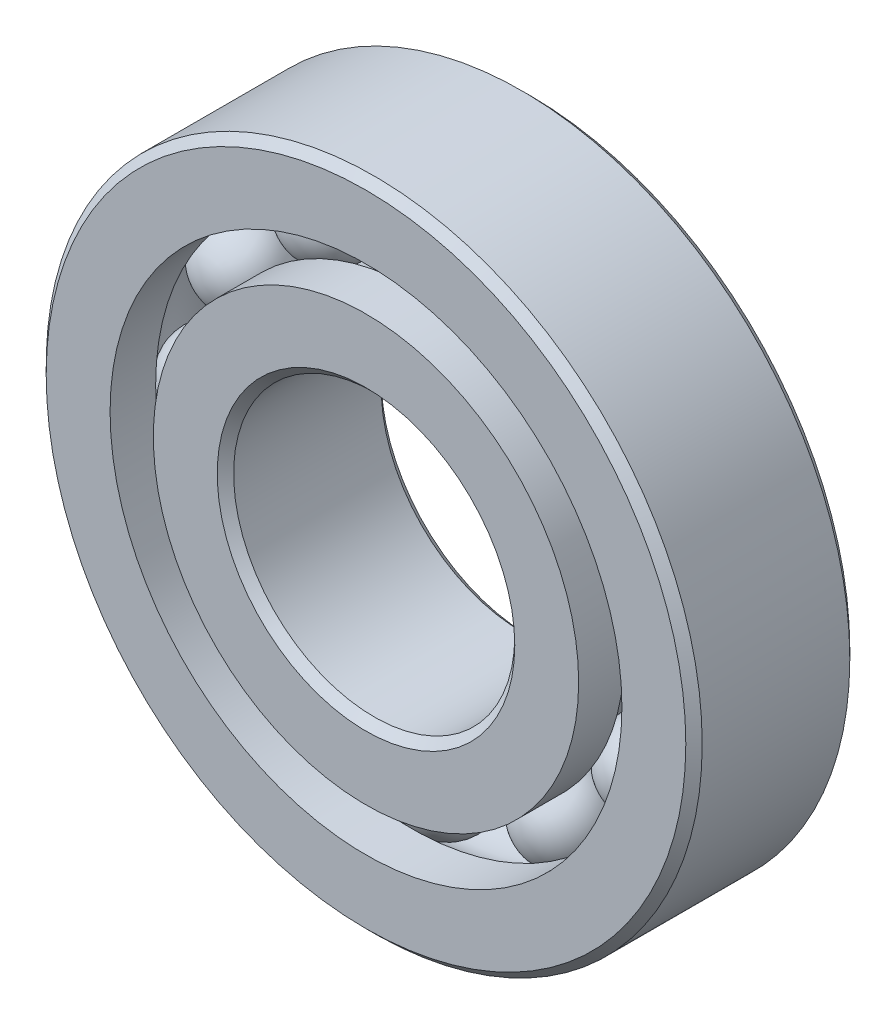
ISO-10303-21;
HEADER;
FILE_DESCRIPTION(('STEP AP214'),'2;1');
FILE_NAME('part.step','',(''),(''),'','','');
FILE_SCHEMA(('AUTOMOTIVE_DESIGN { 1 0 10303 214 1 1 1 1 }'));
ENDSEC;
DATA;
#1=APPLICATION_CONTEXT('core data for automotive mechanical design processes');
#2=APPLICATION_PROTOCOL_DEFINITION('international standard','automotive_design',2000,#1);
#3=PRODUCT_CONTEXT('',#1,'mechanical');
#4=PRODUCT('Part','Part','',(#3));
#5=PRODUCT_RELATED_PRODUCT_CATEGORY('part','',(#4));
#6=PRODUCT_DEFINITION_FORMATION('','',#4);
#7=PRODUCT_DEFINITION_CONTEXT('part definition',#1,'design');
#8=PRODUCT_DEFINITION('design','',#6,#7);
#9=PRODUCT_DEFINITION_SHAPE('','',#8);
#10=(LENGTH_UNIT() NAMED_UNIT(*) SI_UNIT(.MILLI.,.METRE.));
#11=(NAMED_UNIT(*) PLANE_ANGLE_UNIT() SI_UNIT($,.RADIAN.));
#12=(NAMED_UNIT(*) SI_UNIT($,.STERADIAN.) SOLID_ANGLE_UNIT());
#13=UNCERTAINTY_MEASURE_WITH_UNIT(LENGTH_MEASURE(1.E-05),#10,'distance_accuracy_value','');
#14=(GEOMETRIC_REPRESENTATION_CONTEXT(3) GLOBAL_UNCERTAINTY_ASSIGNED_CONTEXT((#13)) GLOBAL_UNIT_ASSIGNED_CONTEXT((#10,
#11,#12)) REPRESENTATION_CONTEXT('',''));
#15=CARTESIAN_POINT('',(0.,0.,0.));
#16=DIRECTION('',(0.,0.,1.));
#17=DIRECTION('',(1.,0.,0.));
#18=AXIS2_PLACEMENT_3D('',#15,#16,#17);
#19=CARTESIAN_POINT('',(-3.96874999999991,6.87407664253903,0.));
#20=DIRECTION('',(0.,0.,1.));
#21=DIRECTION('',(-0.499999999999989,0.866025403784445,0.));
#22=AXIS2_PLACEMENT_3D('',#19,#20,#21);
#23=SPHERICAL_SURFACE('',#22,1.43574962434293);
#24=CARTESIAN_POINT('',(-3.96874999999991,6.87407664253903,1.43574962434293));
#25=VERTEX_POINT('',#24);
#26=VERTEX_LOOP('',#25);
#27=FACE_BOUND('',#26,.T.);
#28=ADVANCED_FACE('F39',(#27),#23,.T.);
#29=CLOSED_SHELL('',(#28));
#30=MANIFOLD_SOLID_BREP('B2',#29);
#31=CARTESIAN_POINT('',(-6.87407664253894,3.96875000000008,0.));
#32=DIRECTION('',(0.,0.,1.));
#33=DIRECTION('',(-0.866025403784433,0.50000000000001,0.));
#34=AXIS2_PLACEMENT_3D('',#31,#32,#33);
#35=SPHERICAL_SURFACE('',#34,1.43574962434293);
#36=CARTESIAN_POINT('',(-6.87407664253894,3.96875000000008,1.43574962434293));
#37=VERTEX_POINT('',#36);
#38=VERTEX_LOOP('',#37);
#39=FACE_BOUND('',#38,.T.);
#40=ADVANCED_FACE('F59',(#39),#35,.T.);
#41=CLOSED_SHELL('',(#40));
#42=MANIFOLD_SOLID_BREP('B6',#41);
#43=CARTESIAN_POINT('',(-7.9375,0.,0.));
#44=DIRECTION('',(0.,0.,1.));
#45=DIRECTION('',(-1.,0.,0.));
#46=AXIS2_PLACEMENT_3D('',#43,#44,#45);
#47=SPHERICAL_SURFACE('',#46,1.43574962434293);
#48=CARTESIAN_POINT('',(-7.9375,0.,1.43574962434293));
#49=VERTEX_POINT('',#48);
#50=VERTEX_LOOP('',#49);
#51=FACE_BOUND('',#50,.T.);
#52=ADVANCED_FACE('F79',(#51),#47,.T.);
#53=CLOSED_SHELL('',(#52));
#54=MANIFOLD_SOLID_BREP('B35',#53);
#55=CARTESIAN_POINT('',(-6.87407664253902,-3.96874999999994,0.));
#56=DIRECTION('',(0.,0.,1.));
#57=DIRECTION('',(-0.866025403784443,-0.499999999999992,0.));
#58=AXIS2_PLACEMENT_3D('',#55,#56,#57);
#59=SPHERICAL_SURFACE('',#58,1.43574962434293);
#60=CARTESIAN_POINT('',(-6.87407664253902,-3.96874999999994,1.43574962434293));
#61=VERTEX_POINT('',#60);
#62=VERTEX_LOOP('',#61);
#63=FACE_BOUND('',#62,.T.);
#64=ADVANCED_FACE('F99',(#63),#59,.T.);
#65=CLOSED_SHELL('',(#64));
#66=MANIFOLD_SOLID_BREP('B55',#65);
#67=CARTESIAN_POINT('',(-3.96875000000006,-6.87407664253895,0.));
#68=DIRECTION('',(0.,0.,1.));
#69=DIRECTION('',(-0.500000000000007,-0.866025403784435,0.));
#70=AXIS2_PLACEMENT_3D('',#67,#68,#69);
#71=SPHERICAL_SURFACE('',#70,1.43574962434293);
#72=CARTESIAN_POINT('',(-3.96875000000006,-6.87407664253895,1.43574962434293));
#73=VERTEX_POINT('',#72);
#74=VERTEX_LOOP('',#73);
#75=FACE_BOUND('',#74,.T.);
#76=ADVANCED_FACE('F119',(#75),#71,.T.);
#77=CLOSED_SHELL('',(#76));
#78=MANIFOLD_SOLID_BREP('B75',#77);
#79=CARTESIAN_POINT('',(0.,-7.9375,0.));
#80=DIRECTION('',(0.,0.,1.));
#81=DIRECTION('',(0.,-1.,0.));
#82=AXIS2_PLACEMENT_3D('',#79,#80,#81);
#83=SPHERICAL_SURFACE('',#82,1.43574962434293);
#84=CARTESIAN_POINT('',(0.,-7.9375,1.43574962434293));
#85=VERTEX_POINT('',#84);
#86=VERTEX_LOOP('',#85);
#87=FACE_BOUND('',#86,.T.);
#88=ADVANCED_FACE('F139',(#87),#83,.T.);
#89=CLOSED_SHELL('',(#88));
#90=MANIFOLD_SOLID_BREP('B95',#89);
#91=CARTESIAN_POINT('',(3.96874999999996,-6.87407664253901,0.));
#92=DIRECTION('',(0.,0.,1.));
#93=DIRECTION('',(0.499999999999995,-0.866025403784442,0.));
#94=AXIS2_PLACEMENT_3D('',#91,#92,#93);
#95=SPHERICAL_SURFACE('',#94,1.43574962434293);
#96=CARTESIAN_POINT('',(3.96874999999996,-6.87407664253901,1.43574962434293));
#97=VERTEX_POINT('',#96);
#98=VERTEX_LOOP('',#97);
#99=FACE_BOUND('',#98,.T.);
#100=ADVANCED_FACE('F159',(#99),#95,.T.);
#101=CLOSED_SHELL('',(#100));
#102=MANIFOLD_SOLID_BREP('B115',#101);
#103=CARTESIAN_POINT('',(6.87407664253896,-3.96875000000003,0.));
#104=DIRECTION('',(0.,0.,1.));
#105=DIRECTION('',(0.866025403784436,-0.500000000000004,0.));
#106=AXIS2_PLACEMENT_3D('',#103,#104,#105);
#107=SPHERICAL_SURFACE('',#106,1.43574962434293);
#108=CARTESIAN_POINT('',(6.87407664253896,-3.96875000000003,1.43574962434293));
#109=VERTEX_POINT('',#108);
#110=VERTEX_LOOP('',#109);
#111=FACE_BOUND('',#110,.T.);
#112=ADVANCED_FACE('F179',(#111),#107,.T.);
#113=CLOSED_SHELL('',(#112));
#114=MANIFOLD_SOLID_BREP('B135',#113);
#115=CARTESIAN_POINT('',(7.9375,0.,0.));
#116=DIRECTION('',(0.,0.,1.));
#117=DIRECTION('',(1.,0.,0.));
#118=AXIS2_PLACEMENT_3D('',#115,#116,#117);
#119=SPHERICAL_SURFACE('',#118,1.43574962434293);
#120=CARTESIAN_POINT('',(7.9375,0.,1.43574962434293));
#121=VERTEX_POINT('',#120);
#122=VERTEX_LOOP('',#121);
#123=FACE_BOUND('',#122,.T.);
#124=ADVANCED_FACE('F199',(#123),#119,.T.);
#125=CLOSED_SHELL('',(#124));
#126=MANIFOLD_SOLID_BREP('B155',#125);
#127=CARTESIAN_POINT('',(6.87407664253899,3.96874999999998,0.));
#128=DIRECTION('',(0.,0.,1.));
#129=DIRECTION('',(0.86602540378444,0.499999999999998,0.));
#130=AXIS2_PLACEMENT_3D('',#127,#128,#129);
#131=SPHERICAL_SURFACE('',#130,1.43574962434293);
#132=CARTESIAN_POINT('',(6.87407664253899,3.96874999999998,1.43574962434293));
#133=VERTEX_POINT('',#132);
#134=VERTEX_LOOP('',#133);
#135=FACE_BOUND('',#134,.T.);
#136=ADVANCED_FACE('F219',(#135),#131,.T.);
#137=CLOSED_SHELL('',(#136));
#138=MANIFOLD_SOLID_BREP('B175',#137);
#139=CARTESIAN_POINT('',(3.96875000000001,6.87407664253898,0.));
#140=DIRECTION('',(0.,0.,1.));
#141=DIRECTION('',(0.500000000000001,0.866025403784438,0.));
#142=AXIS2_PLACEMENT_3D('',#139,#140,#141);
#143=SPHERICAL_SURFACE('',#142,1.43574962434293);
#144=CARTESIAN_POINT('',(3.96875000000001,6.87407664253898,1.43574962434293));
#145=VERTEX_POINT('',#144);
#146=VERTEX_LOOP('',#145);
#147=FACE_BOUND('',#146,.T.);
#148=ADVANCED_FACE('F239',(#147),#143,.T.);
#149=CLOSED_SHELL('',(#148));
#150=MANIFOLD_SOLID_BREP('B195',#149);
#151=CARTESIAN_POINT('',(0.,7.9375,0.));
#152=DIRECTION('',(0.,0.,1.));
#153=DIRECTION('',(0.,1.,0.));
#154=AXIS2_PLACEMENT_3D('',#151,#152,#153);
#155=SPHERICAL_SURFACE('',#154,1.43574962434293);
#156=CARTESIAN_POINT('',(0.,7.9375,1.43574962434293));
#157=VERTEX_POINT('',#156);
#158=VERTEX_LOOP('',#157);
#159=FACE_BOUND('',#158,.T.);
#160=ADVANCED_FACE('F261',(#159),#155,.T.);
#161=CLOSED_SHELL('',(#160));
#162=MANIFOLD_SOLID_BREP('B215',#161);
#163=CARTESIAN_POINT('',(0.,7.20480769230769,2.778125));
#164=DIRECTION('',(0.,0.,-1.));
#165=DIRECTION('',(-1.,0.,0.));
#166=AXIS2_PLACEMENT_3D('',#163,#164,#165);
#167=PLANE('',#166);
#168=CARTESIAN_POINT('',(0.,0.,2.778125));
#169=DIRECTION('',(0.,0.,1.));
#170=DIRECTION('',(1.,0.,0.));
#171=AXIS2_PLACEMENT_3D('',#168,#169,#170);
#172=CIRCLE('',#171,5.0403125);
#173=CARTESIAN_POINT('',(5.0403125,0.,2.778125));
#174=VERTEX_POINT('',#173);
#175=EDGE_CURVE('E308',#174,#174,#172,.T.);
#176=ORIENTED_EDGE('',*,*,#175,.F.);
#177=EDGE_LOOP('',(#176));
#178=FACE_BOUND('',#177,.T.);
#179=CARTESIAN_POINT('',(0.,0.,2.778125));
#180=DIRECTION('',(0.,0.,1.));
#181=DIRECTION('',(1.,0.,0.));
#182=AXIS2_PLACEMENT_3D('',#179,#180,#181);
#183=CIRCLE('',#182,7.20480769230769);
#184=CARTESIAN_POINT('',(7.20480769230769,0.,2.778125));
#185=VERTEX_POINT('',#184);
#186=EDGE_CURVE('E260',#185,#185,#183,.T.);
#187=ORIENTED_EDGE('',*,*,#186,.T.);
#188=EDGE_LOOP('',(#187));
#189=FACE_BOUND('',#188,.T.);
#190=ADVANCED_FACE('F280',(#178,#189),#167,.F.);
#191=CARTESIAN_POINT('',(0.,0.,2.778125));
#192=DIRECTION('',(0.,0.,1.));
#193=DIRECTION('',(1.,0.,0.));
#194=AXIS2_PLACEMENT_3D('',#191,#192,#193);
#195=CYLINDRICAL_SURFACE('',#194,7.20480769230769);
#196=ORIENTED_EDGE('',*,*,#186,.F.);
#197=EDGE_LOOP('',(#196));
#198=FACE_BOUND('',#197,.T.);
#199=CARTESIAN_POINT('',(0.,0.,1.23472222222222));
#200=DIRECTION('',(0.,0.,1.));
#201=DIRECTION('',(1.,0.,0.));
#202=AXIS2_PLACEMENT_3D('',#199,#200,#201);
#203=CIRCLE('',#202,7.20480769230769);
#204=CARTESIAN_POINT('',(7.20480769230769,0.,1.23472222222222));
#205=VERTEX_POINT('',#204);
#206=EDGE_CURVE('E286',#205,#205,#203,.T.);
#207=ORIENTED_EDGE('',*,*,#206,.T.);
#208=EDGE_LOOP('',(#207));
#209=FACE_BOUND('',#208,.T.);
#210=ADVANCED_FACE('F315',(#198,#209),#195,.T.);
#211=CARTESIAN_POINT('',(0.,0.,0.));
#212=DIRECTION('',(0.,0.,1.));
#213=DIRECTION('',(1.,0.,0.));
#214=AXIS2_PLACEMENT_3D('',#211,#212,#213);
#215=TOROIDAL_SURFACE('',#214,7.93749999999999,1.43574962434293);
#216=ORIENTED_EDGE('',*,*,#206,.F.);
#217=EDGE_LOOP('',(#216));
#218=FACE_BOUND('',#217,.T.);
#219=CARTESIAN_POINT('',(0.,0.,-1.23472222222222));
#220=DIRECTION('',(0.,0.,1.));
#221=DIRECTION('',(1.,0.,0.));
#222=AXIS2_PLACEMENT_3D('',#219,#220,#221);
#223=CIRCLE('',#222,7.20480769230769);
#224=CARTESIAN_POINT('',(7.20480769230769,0.,-1.23472222222222));
#225=VERTEX_POINT('',#224);
#226=EDGE_CURVE('E290',#225,#225,#223,.T.);
#227=ORIENTED_EDGE('',*,*,#226,.T.);
#228=EDGE_LOOP('',(#227));
#229=FACE_BOUND('',#228,.T.);
#230=ADVANCED_FACE('F319',(#218,#229),#215,.F.);
#231=CARTESIAN_POINT('',(0.,0.,2.778125));
#232=DIRECTION('',(0.,0.,1.));
#233=DIRECTION('',(1.,0.,0.));
#234=AXIS2_PLACEMENT_3D('',#231,#232,#233);
#235=CYLINDRICAL_SURFACE('',#234,7.20480769230769);
#236=ORIENTED_EDGE('',*,*,#226,.F.);
#237=EDGE_LOOP('',(#236));
#238=FACE_BOUND('',#237,.T.);
#239=CARTESIAN_POINT('',(0.,0.,-2.778125));
#240=DIRECTION('',(0.,0.,1.));
#241=DIRECTION('',(1.,0.,0.));
#242=AXIS2_PLACEMENT_3D('',#239,#240,#241);
#243=CIRCLE('',#242,7.20480769230769);
#244=CARTESIAN_POINT('',(7.20480769230769,0.,-2.778125));
#245=VERTEX_POINT('',#244);
#246=EDGE_CURVE('E294',#245,#245,#243,.T.);
#247=ORIENTED_EDGE('',*,*,#246,.T.);
#248=EDGE_LOOP('',(#247));
#249=FACE_BOUND('',#248,.T.);
#250=ADVANCED_FACE('F324',(#238,#249),#235,.T.);
#251=CARTESIAN_POINT('',(0.,5.0403125,-2.778125));
#252=DIRECTION('',(0.,0.,1.));
#253=DIRECTION('',(1.,0.,0.));
#254=AXIS2_PLACEMENT_3D('',#251,#252,#253);
#255=PLANE('',#254);
#256=ORIENTED_EDGE('',*,*,#246,.F.);
#257=EDGE_LOOP('',(#256));
#258=FACE_BOUND('',#257,.T.);
#259=CARTESIAN_POINT('',(0.,0.,-2.778125));
#260=DIRECTION('',(0.,0.,1.));
#261=DIRECTION('',(1.,0.,0.));
#262=AXIS2_PLACEMENT_3D('',#259,#260,#261);
#263=CIRCLE('',#262,5.0403125);
#264=CARTESIAN_POINT('',(5.0403125,0.,-2.778125));
#265=VERTEX_POINT('',#264);
#266=EDGE_CURVE('E299',#265,#265,#263,.T.);
#267=ORIENTED_EDGE('',*,*,#266,.T.);
#268=EDGE_LOOP('',(#267));
#269=FACE_BOUND('',#268,.T.);
#270=ADVANCED_FACE('F330',(#258,#269),#255,.F.);
#271=CARTESIAN_POINT('',(0.,0.,-2.5003125));
#272=DIRECTION('',(0.,0.,-1.));
#273=DIRECTION('',(-1.,0.,0.));
#274=AXIS2_PLACEMENT_3D('',#271,#272,#273);
#275=CONICAL_SURFACE('',#274,4.7625,0.78539816339745);
#276=ORIENTED_EDGE('',*,*,#266,.F.);
#277=EDGE_LOOP('',(#276));
#278=FACE_BOUND('',#277,.T.);
#279=CARTESIAN_POINT('',(0.,0.,-2.5003125));
#280=DIRECTION('',(0.,0.,1.));
#281=DIRECTION('',(1.,0.,0.));
#282=AXIS2_PLACEMENT_3D('',#279,#280,#281);
#283=CIRCLE('',#282,4.7625);
#284=CARTESIAN_POINT('',(4.7625,0.,-2.5003125));
#285=VERTEX_POINT('',#284);
#286=EDGE_CURVE('E302',#285,#285,#283,.T.);
#287=ORIENTED_EDGE('',*,*,#286,.T.);
#288=EDGE_LOOP('',(#287));
#289=FACE_BOUND('',#288,.T.);
#290=ADVANCED_FACE('F334',(#278,#289),#275,.F.);
#291=CARTESIAN_POINT('',(0.,0.,2.778125));
#292=DIRECTION('',(0.,0.,1.));
#293=DIRECTION('',(1.,0.,0.));
#294=AXIS2_PLACEMENT_3D('',#291,#292,#293);
#295=CYLINDRICAL_SURFACE('',#294,4.7625);
#296=ORIENTED_EDGE('',*,*,#286,.F.);
#297=EDGE_LOOP('',(#296));
#298=FACE_BOUND('',#297,.T.);
#299=CARTESIAN_POINT('',(0.,0.,2.5003125));
#300=DIRECTION('',(0.,0.,1.));
#301=DIRECTION('',(1.,0.,0.));
#302=AXIS2_PLACEMENT_3D('',#299,#300,#301);
#303=CIRCLE('',#302,4.7625);
#304=CARTESIAN_POINT('',(4.7625,0.,2.5003125));
#305=VERTEX_POINT('',#304);
#306=EDGE_CURVE('E305',#305,#305,#303,.T.);
#307=ORIENTED_EDGE('',*,*,#306,.T.);
#308=EDGE_LOOP('',(#307));
#309=FACE_BOUND('',#308,.T.);
#310=ADVANCED_FACE('F338',(#298,#309),#295,.F.);
#311=CARTESIAN_POINT('',(0.,0.,2.778125));
#312=DIRECTION('',(0.,0.,1.));
#313=DIRECTION('',(1.,0.,0.));
#314=AXIS2_PLACEMENT_3D('',#311,#312,#313);
#315=CONICAL_SURFACE('',#314,5.0403125,0.785398163397448);
#316=ORIENTED_EDGE('',*,*,#306,.F.);
#317=EDGE_LOOP('',(#316));
#318=FACE_BOUND('',#317,.T.);
#319=ORIENTED_EDGE('',*,*,#175,.T.);
#320=EDGE_LOOP('',(#319));
#321=FACE_BOUND('',#320,.T.);
#322=ADVANCED_FACE('F312',(#318,#321),#315,.F.);
#323=CLOSED_SHELL('',(#190,#210,#230,#250,#270,#290,#310,#322));
#324=MANIFOLD_SOLID_BREP('B235',#323);
#325=CARTESIAN_POINT('',(0.,0.,2.5003125));
#326=DIRECTION('',(0.,0.,-1.));
#327=DIRECTION('',(-1.,0.,0.));
#328=AXIS2_PLACEMENT_3D('',#325,#326,#327);
#329=CONICAL_SURFACE('',#328,11.1125,0.785398163397451);
#330=CARTESIAN_POINT('',(0.,0.,2.778125));
#331=DIRECTION('',(0.,0.,1.));
#332=DIRECTION('',(1.,0.,0.));
#333=AXIS2_PLACEMENT_3D('',#330,#331,#332);
#334=CIRCLE('',#333,10.8346875);
#335=CARTESIAN_POINT('',(10.8346875,0.,2.778125));
#336=VERTEX_POINT('',#335);
#337=EDGE_CURVE('E429',#336,#336,#334,.T.);
#338=ORIENTED_EDGE('',*,*,#337,.F.);
#339=EDGE_LOOP('',(#338));
#340=FACE_BOUND('',#339,.T.);
#341=CARTESIAN_POINT('',(0.,0.,2.5003125));
#342=DIRECTION('',(0.,0.,1.));
#343=DIRECTION('',(1.,0.,0.));
#344=AXIS2_PLACEMENT_3D('',#341,#342,#343);
#345=CIRCLE('',#344,11.1125);
#346=CARTESIAN_POINT('',(11.1125,0.,2.5003125));
#347=VERTEX_POINT('',#346);
#348=EDGE_CURVE('E279',#347,#347,#345,.T.);
#349=ORIENTED_EDGE('',*,*,#348,.T.);
#350=EDGE_LOOP('',(#349));
#351=FACE_BOUND('',#350,.T.);
#352=ADVANCED_FACE('F401',(#340,#351),#329,.T.);
#353=CARTESIAN_POINT('',(0.,0.,2.778125));
#354=DIRECTION('',(0.,0.,1.));
#355=DIRECTION('',(1.,0.,0.));
#356=AXIS2_PLACEMENT_3D('',#353,#354,#355);
#357=CYLINDRICAL_SURFACE('',#356,11.1125);
#358=ORIENTED_EDGE('',*,*,#348,.F.);
#359=EDGE_LOOP('',(#358));
#360=FACE_BOUND('',#359,.T.);
#361=CARTESIAN_POINT('',(0.,0.,-2.5003125));
#362=DIRECTION('',(0.,0.,1.));
#363=DIRECTION('',(1.,0.,0.));
#364=AXIS2_PLACEMENT_3D('',#361,#362,#363);
#365=CIRCLE('',#364,11.1125);
#366=CARTESIAN_POINT('',(11.1125,0.,-2.5003125));
#367=VERTEX_POINT('',#366);
#368=EDGE_CURVE('E407',#367,#367,#365,.T.);
#369=ORIENTED_EDGE('',*,*,#368,.T.);
#370=EDGE_LOOP('',(#369));
#371=FACE_BOUND('',#370,.T.);
#372=ADVANCED_FACE('F436',(#360,#371),#357,.T.);
#373=CARTESIAN_POINT('',(0.,0.,-2.778125));
#374=DIRECTION('',(0.,0.,1.));
#375=DIRECTION('',(1.,0.,0.));
#376=AXIS2_PLACEMENT_3D('',#373,#374,#375);
#377=CONICAL_SURFACE('',#376,10.8346875,0.785398163397451);
#378=ORIENTED_EDGE('',*,*,#368,.F.);
#379=EDGE_LOOP('',(#378));
#380=FACE_BOUND('',#379,.T.);
#381=CARTESIAN_POINT('',(0.,0.,-2.778125));
#382=DIRECTION('',(0.,0.,1.));
#383=DIRECTION('',(1.,0.,0.));
#384=AXIS2_PLACEMENT_3D('',#381,#382,#383);
#385=CIRCLE('',#384,10.8346875);
#386=CARTESIAN_POINT('',(10.8346875,0.,-2.778125));
#387=VERTEX_POINT('',#386);
#388=EDGE_CURVE('E411',#387,#387,#385,.T.);
#389=ORIENTED_EDGE('',*,*,#388,.T.);
#390=EDGE_LOOP('',(#389));
#391=FACE_BOUND('',#390,.T.);
#392=ADVANCED_FACE('F440',(#380,#391),#377,.T.);
#393=CARTESIAN_POINT('',(0.,10.8346875,-2.778125));
#394=DIRECTION('',(0.,0.,1.));
#395=DIRECTION('',(1.,0.,0.));
#396=AXIS2_PLACEMENT_3D('',#393,#394,#395);
#397=PLANE('',#396);
#398=ORIENTED_EDGE('',*,*,#388,.F.);
#399=EDGE_LOOP('',(#398));
#400=FACE_BOUND('',#399,.T.);
#401=CARTESIAN_POINT('',(0.,0.,-2.778125));
#402=DIRECTION('',(0.,0.,1.));
#403=DIRECTION('',(1.,0.,0.));
#404=AXIS2_PLACEMENT_3D('',#401,#402,#403);
#405=CIRCLE('',#404,8.67019230769231);
#406=CARTESIAN_POINT('',(8.67019230769231,0.,-2.778125));
#407=VERTEX_POINT('',#406);
#408=EDGE_CURVE('E415',#407,#407,#405,.T.);
#409=ORIENTED_EDGE('',*,*,#408,.T.);
#410=EDGE_LOOP('',(#409));
#411=FACE_BOUND('',#410,.T.);
#412=ADVANCED_FACE('F445',(#400,#411),#397,.F.);
#413=CARTESIAN_POINT('',(0.,0.,2.778125));
#414=DIRECTION('',(0.,0.,1.));
#415=DIRECTION('',(1.,0.,0.));
#416=AXIS2_PLACEMENT_3D('',#413,#414,#415);
#417=CYLINDRICAL_SURFACE('',#416,8.67019230769231);
#418=ORIENTED_EDGE('',*,*,#408,.F.);
#419=EDGE_LOOP('',(#418));
#420=FACE_BOUND('',#419,.T.);
#421=CARTESIAN_POINT('',(0.,0.,-1.23472222222222));
#422=DIRECTION('',(0.,0.,1.));
#423=DIRECTION('',(1.,0.,0.));
#424=AXIS2_PLACEMENT_3D('',#421,#422,#423);
#425=CIRCLE('',#424,8.67019230769231);
#426=CARTESIAN_POINT('',(8.67019230769231,0.,-1.23472222222222));
#427=VERTEX_POINT('',#426);
#428=EDGE_CURVE('E420',#427,#427,#425,.T.);
#429=ORIENTED_EDGE('',*,*,#428,.T.);
#430=EDGE_LOOP('',(#429));
#431=FACE_BOUND('',#430,.T.);
#432=ADVANCED_FACE('F451',(#420,#431),#417,.F.);
#433=CARTESIAN_POINT('',(0.,0.,0.));
#434=DIRECTION('',(0.,0.,1.));
#435=DIRECTION('',(1.,0.,0.));
#436=AXIS2_PLACEMENT_3D('',#433,#434,#435);
#437=TOROIDAL_SURFACE('',#436,7.9375,1.43574962434293);
#438=ORIENTED_EDGE('',*,*,#428,.F.);
#439=EDGE_LOOP('',(#438));
#440=FACE_BOUND('',#439,.T.);
#441=CARTESIAN_POINT('',(0.,0.,1.23472222222222));
#442=DIRECTION('',(0.,0.,1.));
#443=DIRECTION('',(1.,0.,0.));
#444=AXIS2_PLACEMENT_3D('',#441,#442,#443);
#445=CIRCLE('',#444,8.67019230769231);
#446=CARTESIAN_POINT('',(8.67019230769231,0.,1.23472222222222));
#447=VERTEX_POINT('',#446);
#448=EDGE_CURVE('E423',#447,#447,#445,.T.);
#449=ORIENTED_EDGE('',*,*,#448,.T.);
#450=EDGE_LOOP('',(#449));
#451=FACE_BOUND('',#450,.T.);
#452=ADVANCED_FACE('F455',(#440,#451),#437,.F.);
#453=CARTESIAN_POINT('',(0.,0.,2.778125));
#454=DIRECTION('',(0.,0.,1.));
#455=DIRECTION('',(1.,0.,0.));
#456=AXIS2_PLACEMENT_3D('',#453,#454,#455);
#457=CYLINDRICAL_SURFACE('',#456,8.67019230769231);
#458=ORIENTED_EDGE('',*,*,#448,.F.);
#459=EDGE_LOOP('',(#458));
#460=FACE_BOUND('',#459,.T.);
#461=CARTESIAN_POINT('',(0.,0.,2.778125));
#462=DIRECTION('',(0.,0.,1.));
#463=DIRECTION('',(1.,0.,0.));
#464=AXIS2_PLACEMENT_3D('',#461,#462,#463);
#465=CIRCLE('',#464,8.67019230769231);
#466=CARTESIAN_POINT('',(8.67019230769231,0.,2.778125));
#467=VERTEX_POINT('',#466);
#468=EDGE_CURVE('E426',#467,#467,#465,.T.);
#469=ORIENTED_EDGE('',*,*,#468,.T.);
#470=EDGE_LOOP('',(#469));
#471=FACE_BOUND('',#470,.T.);
#472=ADVANCED_FACE('F459',(#460,#471),#457,.F.);
#473=CARTESIAN_POINT('',(0.,10.8346875,2.778125));
#474=DIRECTION('',(0.,0.,-1.));
#475=DIRECTION('',(-1.,0.,0.));
#476=AXIS2_PLACEMENT_3D('',#473,#474,#475);
#477=PLANE('',#476);
#478=ORIENTED_EDGE('',*,*,#468,.F.);
#479=EDGE_LOOP('',(#478));
#480=FACE_BOUND('',#479,.T.);
#481=ORIENTED_EDGE('',*,*,#337,.T.);
#482=EDGE_LOOP('',(#481));
#483=FACE_BOUND('',#482,.T.);
#484=ADVANCED_FACE('F433',(#480,#483),#477,.F.);
#485=CLOSED_SHELL('',(#352,#372,#392,#412,#432,#452,#472,#484));
#486=MANIFOLD_SOLID_BREP('B255',#485);
#487=ADVANCED_BREP_SHAPE_REPRESENTATION('',(#18,#30,#42,#54,#66,#78,#90,#102,#114,#126,#138,
#150,#162,#324,#486),#14);
#488=SHAPE_DEFINITION_REPRESENTATION(#9,#487);
ENDSEC;
END-ISO-10303-21;
